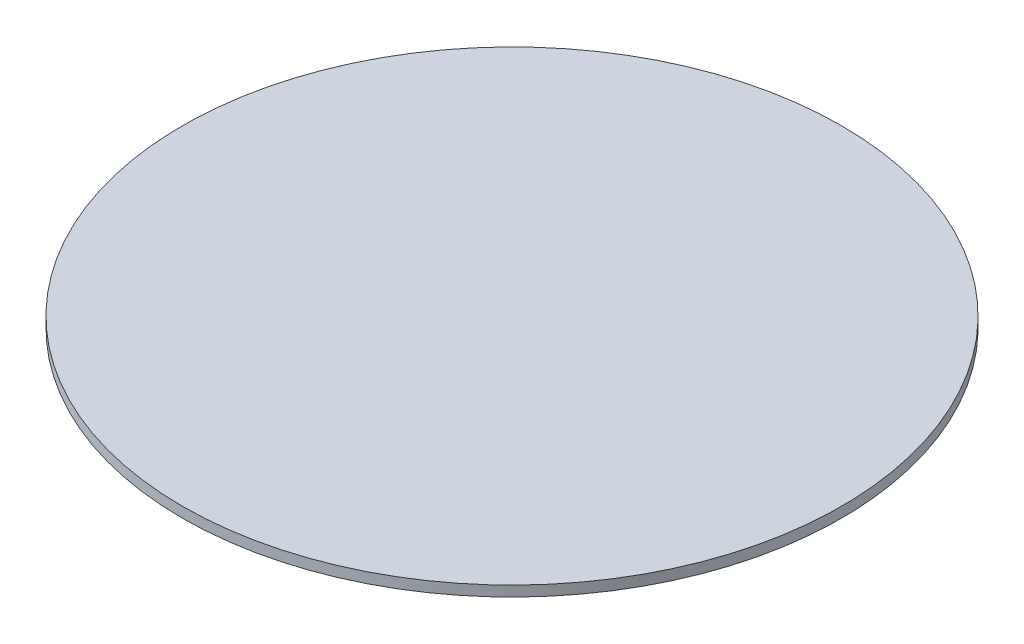
ISO-10303-21;
HEADER;
FILE_DESCRIPTION(('STEP AP214'),'2;1');
FILE_NAME('part.step','',(''),(''),'','','');
FILE_SCHEMA(('AUTOMOTIVE_DESIGN { 1 0 10303 214 1 1 1 1 }'));
ENDSEC;
DATA;
#1=APPLICATION_CONTEXT('core data for automotive mechanical design processes');
#2=APPLICATION_PROTOCOL_DEFINITION('international standard','automotive_design',2000,#1);
#3=PRODUCT_CONTEXT('',#1,'mechanical');
#4=PRODUCT('Part','Part','',(#3));
#5=PRODUCT_RELATED_PRODUCT_CATEGORY('part','',(#4));
#6=PRODUCT_DEFINITION_FORMATION('','',#4);
#7=PRODUCT_DEFINITION_CONTEXT('part definition',#1,'design');
#8=PRODUCT_DEFINITION('design','',#6,#7);
#9=PRODUCT_DEFINITION_SHAPE('','',#8);
#10=(LENGTH_UNIT() NAMED_UNIT(*) SI_UNIT(.MILLI.,.METRE.));
#11=(NAMED_UNIT(*) PLANE_ANGLE_UNIT() SI_UNIT($,.RADIAN.));
#12=(NAMED_UNIT(*) SI_UNIT($,.STERADIAN.) SOLID_ANGLE_UNIT());
#13=UNCERTAINTY_MEASURE_WITH_UNIT(LENGTH_MEASURE(1.E-05),#10,'distance_accuracy_value','');
#14=(GEOMETRIC_REPRESENTATION_CONTEXT(3) GLOBAL_UNCERTAINTY_ASSIGNED_CONTEXT((#13)) GLOBAL_UNIT_ASSIGNED_CONTEXT((#10,
#11,#12)) REPRESENTATION_CONTEXT('',''));
#15=CARTESIAN_POINT('',(0.,0.,0.));
#16=DIRECTION('',(0.,0.,1.));
#17=DIRECTION('',(1.,0.,0.));
#18=AXIS2_PLACEMENT_3D('',#15,#16,#17);
#19=CARTESIAN_POINT('',(0.,5.,0.));
#20=DIRECTION('',(0.,-1.,0.));
#21=DIRECTION('',(0.,0.,-1.));
#22=AXIS2_PLACEMENT_3D('',#19,#20,#21);
#23=CYLINDRICAL_SURFACE('',#22,158.75);
#24=CARTESIAN_POINT('',(0.,5.,0.));
#25=DIRECTION('',(0.,1.,0.));
#26=DIRECTION('',(0.,0.,1.));
#27=AXIS2_PLACEMENT_3D('',#24,#25,#26);
#28=CIRCLE('',#27,158.75);
#29=CARTESIAN_POINT('',(0.,5.,158.75));
#30=VERTEX_POINT('',#29);
#31=EDGE_CURVE('E10',#30,#30,#28,.T.);
#32=ORIENTED_EDGE('',*,*,#31,.F.);
#33=EDGE_LOOP('',(#32));
#34=FACE_BOUND('',#33,.T.);
#35=CARTESIAN_POINT('',(0.,0.,0.));
#36=DIRECTION('',(0.,1.,0.));
#37=DIRECTION('',(0.,0.,1.));
#38=AXIS2_PLACEMENT_3D('',#35,#36,#37);
#39=CIRCLE('',#38,158.75);
#40=CARTESIAN_POINT('',(0.,0.,158.75));
#41=VERTEX_POINT('',#40);
#42=EDGE_CURVE('E34',#41,#41,#39,.T.);
#43=ORIENTED_EDGE('',*,*,#42,.T.);
#44=EDGE_LOOP('',(#43));
#45=FACE_BOUND('',#44,.T.);
#46=ADVANCED_FACE('F31',(#34,#45),#23,.T.);
#47=CARTESIAN_POINT('',(0.,5.,0.));
#48=DIRECTION('',(0.,1.,0.));
#49=DIRECTION('',(0.,0.,1.));
#50=AXIS2_PLACEMENT_3D('',#47,#48,#49);
#51=PLANE('',#50);
#52=ORIENTED_EDGE('',*,*,#31,.T.);
#53=EDGE_LOOP('',(#52));
#54=FACE_BOUND('',#53,.T.);
#55=ADVANCED_FACE('F46',(#54),#51,.T.);
#56=CARTESIAN_POINT('',(0.,0.,0.));
#57=DIRECTION('',(0.,1.,0.));
#58=DIRECTION('',(0.,0.,1.));
#59=AXIS2_PLACEMENT_3D('',#56,#57,#58);
#60=PLANE('',#59);
#61=ORIENTED_EDGE('',*,*,#42,.F.);
#62=EDGE_LOOP('',(#61));
#63=FACE_BOUND('',#62,.T.);
#64=ADVANCED_FACE('F44',(#63),#60,.F.);
#65=CLOSED_SHELL('',(#46,#55,#64));
#66=MANIFOLD_SOLID_BREP('B2',#65);
#67=ADVANCED_BREP_SHAPE_REPRESENTATION('',(#18,#66),#14);
#68=SHAPE_DEFINITION_REPRESENTATION(#9,#67);
ENDSEC;
END-ISO-10303-21;
